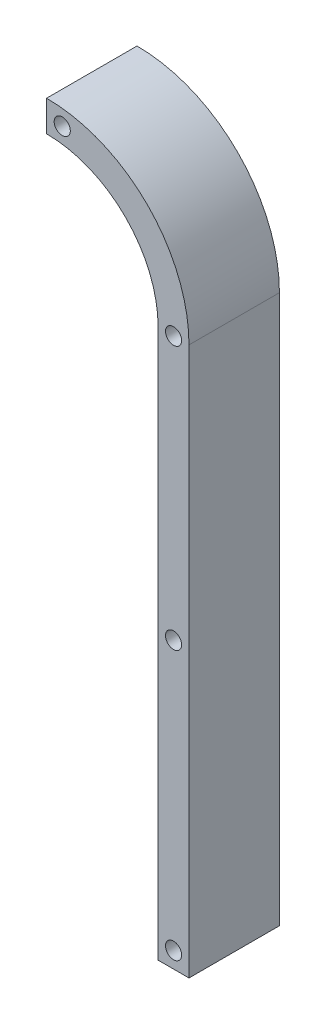
ISO-10303-21;
HEADER;
FILE_DESCRIPTION(('STEP AP214'),'2;1');
FILE_NAME('part.step','',(''),(''),'','','');
FILE_SCHEMA(('AUTOMOTIVE_DESIGN { 1 0 10303 214 1 1 1 1 }'));
ENDSEC;
DATA;
#1=APPLICATION_CONTEXT('core data for automotive mechanical design processes');
#2=APPLICATION_PROTOCOL_DEFINITION('international standard','automotive_design',2000,#1);
#3=PRODUCT_CONTEXT('',#1,'mechanical');
#4=PRODUCT('Part','Part','',(#3));
#5=PRODUCT_RELATED_PRODUCT_CATEGORY('part','',(#4));
#6=PRODUCT_DEFINITION_FORMATION('','',#4);
#7=PRODUCT_DEFINITION_CONTEXT('part definition',#1,'design');
#8=PRODUCT_DEFINITION('design','',#6,#7);
#9=PRODUCT_DEFINITION_SHAPE('','',#8);
#10=(LENGTH_UNIT() NAMED_UNIT(*) SI_UNIT(.MILLI.,.METRE.));
#11=(NAMED_UNIT(*) PLANE_ANGLE_UNIT() SI_UNIT($,.RADIAN.));
#12=(NAMED_UNIT(*) SI_UNIT($,.STERADIAN.) SOLID_ANGLE_UNIT());
#13=UNCERTAINTY_MEASURE_WITH_UNIT(LENGTH_MEASURE(1.E-05),#10,'distance_accuracy_value','');
#14=(GEOMETRIC_REPRESENTATION_CONTEXT(3) GLOBAL_UNCERTAINTY_ASSIGNED_CONTEXT((#13)) GLOBAL_UNIT_ASSIGNED_CONTEXT((#10,
#11,#12)) REPRESENTATION_CONTEXT('',''));
#15=CARTESIAN_POINT('',(0.,0.,0.));
#16=DIRECTION('',(0.,0.,1.));
#17=DIRECTION('',(1.,0.,0.));
#18=AXIS2_PLACEMENT_3D('',#15,#16,#17);
#19=CARTESIAN_POINT('',(-149.085368150531,212.188334745558,19.05));
#20=DIRECTION('',(0.,0.,-1.));
#21=DIRECTION('',(-1.,0.,0.));
#22=AXIS2_PLACEMENT_3D('',#19,#20,#21);
#23=CYLINDRICAL_SURFACE('',#22,23.5);
#24=CARTESIAN_POINT('',(-149.085368150531,212.188334745558,0.));
#25=DIRECTION('',(0.,0.,1.));
#26=DIRECTION('',(1.,0.,0.));
#27=AXIS2_PLACEMENT_3D('',#24,#25,#26);
#28=CIRCLE('',#27,23.5);
#29=CARTESIAN_POINT('',(-125.585368150531,212.188334745558,0.));
#30=VERTEX_POINT('',#29);
#31=CARTESIAN_POINT('',(-149.085368150531,235.688334745558,0.));
#32=VERTEX_POINT('',#31);
#33=EDGE_CURVE('E118',#30,#32,#28,.T.);
#34=ORIENTED_EDGE('',*,*,#33,.F.);
#35=DIRECTION('',(0.,0.,-1.));
#36=VECTOR('',#35,1.);
#37=CARTESIAN_POINT('',(-125.585368150531,212.188334745558,19.05));
#38=LINE('',#37,#36);
#39=CARTESIAN_POINT('',(-125.585368150531,212.188334745558,19.05));
#40=VERTEX_POINT('',#39);
#41=EDGE_CURVE('E11',#40,#30,#38,.T.);
#42=ORIENTED_EDGE('',*,*,#41,.F.);
#43=CARTESIAN_POINT('',(-149.085368150531,212.188334745558,19.05));
#44=DIRECTION('',(0.,0.,1.));
#45=DIRECTION('',(1.,0.,0.));
#46=AXIS2_PLACEMENT_3D('',#43,#44,#45);
#47=CIRCLE('',#46,23.5);
#48=CARTESIAN_POINT('',(-149.085368150531,235.688334745558,19.05));
#49=VERTEX_POINT('',#48);
#50=EDGE_CURVE('E133',#40,#49,#47,.T.);
#51=ORIENTED_EDGE('',*,*,#50,.T.);
#52=DIRECTION('',(0.,0.,-1.));
#53=VECTOR('',#52,1.);
#54=CARTESIAN_POINT('',(-149.085368150531,235.688334745558,19.05));
#55=LINE('',#54,#53);
#56=EDGE_CURVE('E36',#49,#32,#55,.T.);
#57=ORIENTED_EDGE('',*,*,#56,.T.);
#58=EDGE_LOOP('',(#34,#42,#51,#57));
#59=FACE_BOUND('',#58,.T.);
#60=ADVANCED_FACE('F33',(#59),#23,.F.);
#61=CARTESIAN_POINT('',(-125.585368150531,96.6995702810626,19.05));
#62=DIRECTION('',(-1.,0.,0.));
#63=DIRECTION('',(0.,-1.,0.));
#64=AXIS2_PLACEMENT_3D('',#61,#62,#63);
#65=PLANE('',#64);
#66=DIRECTION('',(0.,1.,0.));
#67=VECTOR('',#66,1.);
#68=CARTESIAN_POINT('',(-125.585368150531,96.6995702810626,0.));
#69=LINE('',#68,#67);
#70=CARTESIAN_POINT('',(-125.585368150531,96.6995702810626,0.));
#71=VERTEX_POINT('',#70);
#72=EDGE_CURVE('E131',#71,#30,#69,.T.);
#73=ORIENTED_EDGE('',*,*,#72,.F.);
#74=DIRECTION('',(0.,0.,-1.));
#75=VECTOR('',#74,1.);
#76=CARTESIAN_POINT('',(-125.585368150531,96.6995702810626,19.05));
#77=LINE('',#76,#75);
#78=CARTESIAN_POINT('',(-125.585368150531,96.6995702810626,19.05));
#79=VERTEX_POINT('',#78);
#80=EDGE_CURVE('E42',#79,#71,#77,.T.);
#81=ORIENTED_EDGE('',*,*,#80,.F.);
#82=DIRECTION('',(0.,1.,0.));
#83=VECTOR('',#82,1.);
#84=CARTESIAN_POINT('',(-125.585368150531,96.6995702810626,19.05));
#85=LINE('',#84,#83);
#86=EDGE_CURVE('E108',#79,#40,#85,.T.);
#87=ORIENTED_EDGE('',*,*,#86,.T.);
#88=ORIENTED_EDGE('',*,*,#41,.T.);
#89=EDGE_LOOP('',(#73,#81,#87,#88));
#90=FACE_BOUND('',#89,.T.);
#91=ADVANCED_FACE('F141',(#90),#65,.T.);
#92=CARTESIAN_POINT('',(-119.085368150531,96.6995702810626,19.05));
#93=DIRECTION('',(0.,-1.,0.));
#94=DIRECTION('',(0.,0.,-1.));
#95=AXIS2_PLACEMENT_3D('',#92,#93,#94);
#96=PLANE('',#95);
#97=DIRECTION('',(-1.,0.,0.));
#98=VECTOR('',#97,1.);
#99=CARTESIAN_POINT('',(-119.085368150531,96.6995702810626,0.));
#100=LINE('',#99,#98);
#101=CARTESIAN_POINT('',(-119.085368150531,96.6995702810626,0.));
#102=VERTEX_POINT('',#101);
#103=EDGE_CURVE('E95',#102,#71,#100,.T.);
#104=ORIENTED_EDGE('',*,*,#103,.F.);
#105=DIRECTION('',(0.,0.,-1.));
#106=VECTOR('',#105,1.);
#107=CARTESIAN_POINT('',(-119.085368150531,96.6995702810626,19.05));
#108=LINE('',#107,#106);
#109=CARTESIAN_POINT('',(-119.085368150531,96.6995702810626,19.05));
#110=VERTEX_POINT('',#109);
#111=EDGE_CURVE('E90',#110,#102,#108,.T.);
#112=ORIENTED_EDGE('',*,*,#111,.F.);
#113=DIRECTION('',(-1.,0.,0.));
#114=VECTOR('',#113,1.);
#115=CARTESIAN_POINT('',(-119.085368150531,96.6995702810626,19.05));
#116=LINE('',#115,#114);
#117=EDGE_CURVE('E93',#110,#79,#116,.T.);
#118=ORIENTED_EDGE('',*,*,#117,.T.);
#119=ORIENTED_EDGE('',*,*,#80,.T.);
#120=EDGE_LOOP('',(#104,#112,#118,#119));
#121=FACE_BOUND('',#120,.T.);
#122=ADVANCED_FACE('F92',(#121),#96,.T.);
#123=CARTESIAN_POINT('',(-119.085368150531,212.188334745558,19.05));
#124=DIRECTION('',(1.,0.,0.));
#125=DIRECTION('',(0.,0.,-1.));
#126=AXIS2_PLACEMENT_3D('',#123,#124,#125);
#127=PLANE('',#126);
#128=DIRECTION('',(0.,-1.,0.));
#129=VECTOR('',#128,1.);
#130=CARTESIAN_POINT('',(-119.085368150531,212.188334745558,0.));
#131=LINE('',#130,#129);
#132=CARTESIAN_POINT('',(-119.085368150531,212.188334745558,0.));
#133=VERTEX_POINT('',#132);
#134=EDGE_CURVE('E128',#133,#102,#131,.T.);
#135=ORIENTED_EDGE('',*,*,#134,.F.);
#136=DIRECTION('',(0.,0.,-1.));
#137=VECTOR('',#136,1.);
#138=CARTESIAN_POINT('',(-119.085368150531,212.188334745558,19.05));
#139=LINE('',#138,#137);
#140=CARTESIAN_POINT('',(-119.085368150531,212.188334745558,19.05));
#141=VERTEX_POINT('',#140);
#142=EDGE_CURVE('E100',#141,#133,#139,.T.);
#143=ORIENTED_EDGE('',*,*,#142,.F.);
#144=DIRECTION('',(0.,-1.,0.));
#145=VECTOR('',#144,1.);
#146=CARTESIAN_POINT('',(-119.085368150531,212.188334745558,19.05));
#147=LINE('',#146,#145);
#148=EDGE_CURVE('E106',#141,#110,#147,.T.);
#149=ORIENTED_EDGE('',*,*,#148,.T.);
#150=ORIENTED_EDGE('',*,*,#111,.T.);
#151=EDGE_LOOP('',(#135,#143,#149,#150));
#152=FACE_BOUND('',#151,.T.);
#153=ADVANCED_FACE('F110',(#152),#127,.T.);
#154=CARTESIAN_POINT('',(-149.085368150531,212.188334745558,19.05));
#155=DIRECTION('',(0.,0.,-1.));
#156=DIRECTION('',(-1.,0.,0.));
#157=AXIS2_PLACEMENT_3D('',#154,#155,#156);
#158=CYLINDRICAL_SURFACE('',#157,30.);
#159=CARTESIAN_POINT('',(-149.085368150531,212.188334745558,0.));
#160=DIRECTION('',(0.,0.,-1.));
#161=DIRECTION('',(-1.,0.,0.));
#162=AXIS2_PLACEMENT_3D('',#159,#160,#161);
#163=CIRCLE('',#162,30.);
#164=CARTESIAN_POINT('',(-149.085368150531,242.188334745558,0.));
#165=VERTEX_POINT('',#164);
#166=EDGE_CURVE('E125',#165,#133,#163,.T.);
#167=ORIENTED_EDGE('',*,*,#166,.F.);
#168=DIRECTION('',(0.,0.,-1.));
#169=VECTOR('',#168,1.);
#170=CARTESIAN_POINT('',(-149.085368150531,242.188334745558,19.05));
#171=LINE('',#170,#169);
#172=CARTESIAN_POINT('',(-149.085368150531,242.188334745558,19.05));
#173=VERTEX_POINT('',#172);
#174=EDGE_CURVE('E136',#173,#165,#171,.T.);
#175=ORIENTED_EDGE('',*,*,#174,.F.);
#176=CARTESIAN_POINT('',(-149.085368150531,212.188334745558,19.05));
#177=DIRECTION('',(0.,0.,-1.));
#178=DIRECTION('',(-1.,0.,0.));
#179=AXIS2_PLACEMENT_3D('',#176,#177,#178);
#180=CIRCLE('',#179,30.);
#181=EDGE_CURVE('E111',#173,#141,#180,.T.);
#182=ORIENTED_EDGE('',*,*,#181,.T.);
#183=ORIENTED_EDGE('',*,*,#142,.T.);
#184=EDGE_LOOP('',(#167,#175,#182,#183));
#185=FACE_BOUND('',#184,.T.);
#186=ADVANCED_FACE('F154',(#185),#158,.T.);
#187=CARTESIAN_POINT('',(-149.085368150531,235.688334745558,19.05));
#188=DIRECTION('',(-1.,0.,0.));
#189=DIRECTION('',(0.,0.,1.));
#190=AXIS2_PLACEMENT_3D('',#187,#188,#189);
#191=PLANE('',#190);
#192=DIRECTION('',(0.,1.,0.));
#193=VECTOR('',#192,1.);
#194=CARTESIAN_POINT('',(-149.085368150531,235.688334745558,0.));
#195=LINE('',#194,#193);
#196=EDGE_CURVE('E121',#32,#165,#195,.T.);
#197=ORIENTED_EDGE('',*,*,#196,.F.);
#198=ORIENTED_EDGE('',*,*,#56,.F.);
#199=DIRECTION('',(0.,1.,0.));
#200=VECTOR('',#199,1.);
#201=CARTESIAN_POINT('',(-149.085368150531,235.688334745558,19.05));
#202=LINE('',#201,#200);
#203=EDGE_CURVE('E113',#49,#173,#202,.T.);
#204=ORIENTED_EDGE('',*,*,#203,.T.);
#205=ORIENTED_EDGE('',*,*,#174,.T.);
#206=EDGE_LOOP('',(#197,#198,#204,#205));
#207=FACE_BOUND('',#206,.T.);
#208=ADVANCED_FACE('F138',(#207),#191,.T.);
#209=CARTESIAN_POINT('',(-149.085368150531,212.188334745558,19.05));
#210=DIRECTION('',(0.,0.,1.));
#211=DIRECTION('',(1.,0.,0.));
#212=AXIS2_PLACEMENT_3D('',#209,#210,#211);
#213=PLANE('',#212);
#214=CARTESIAN_POINT('',(-122.335368150531,100.099570281063,19.05));
#215=DIRECTION('',(0.,0.,-1.));
#216=DIRECTION('',(1.,0.,0.));
#217=AXIS2_PLACEMENT_3D('',#214,#215,#216);
#218=CIRCLE('',#217,1.69999999999999);
#219=CARTESIAN_POINT('',(-120.635368150531,100.099570281063,19.05));
#220=VERTEX_POINT('',#219);
#221=EDGE_CURVE('E188',#220,#220,#218,.T.);
#222=ORIENTED_EDGE('',*,*,#221,.T.);
#223=EDGE_LOOP('',(#222));
#224=FACE_BOUND('',#223,.T.);
#225=CARTESIAN_POINT('',(-122.335368150531,156.699570281063,19.05));
#226=DIRECTION('',(0.,0.,-1.));
#227=DIRECTION('',(1.,0.,0.));
#228=AXIS2_PLACEMENT_3D('',#225,#226,#227);
#229=CIRCLE('',#228,1.70000000000001);
#230=CARTESIAN_POINT('',(-120.635368150531,156.699570281063,19.05));
#231=VERTEX_POINT('',#230);
#232=EDGE_CURVE('E196',#231,#231,#229,.T.);
#233=ORIENTED_EDGE('',*,*,#232,.T.);
#234=EDGE_LOOP('',(#233));
#235=FACE_BOUND('',#234,.T.);
#236=CARTESIAN_POINT('',(-122.335368150529,212.18833474556,19.05));
#237=DIRECTION('',(0.,0.,-1.));
#238=DIRECTION('',(1.,0.,0.));
#239=AXIS2_PLACEMENT_3D('',#236,#237,#238);
#240=CIRCLE('',#239,1.70000000000001);
#241=CARTESIAN_POINT('',(-120.635368150529,212.18833474556,19.05));
#242=VERTEX_POINT('',#241);
#243=EDGE_CURVE('E202',#242,#242,#240,.T.);
#244=ORIENTED_EDGE('',*,*,#243,.T.);
#245=EDGE_LOOP('',(#244));
#246=FACE_BOUND('',#245,.T.);
#247=CARTESIAN_POINT('',(-145.785368150531,238.734002942083,19.05));
#248=DIRECTION('',(0.,0.,-1.));
#249=DIRECTION('',(1.,0.,0.));
#250=AXIS2_PLACEMENT_3D('',#247,#248,#249);
#251=CIRCLE('',#250,1.70000000000001);
#252=CARTESIAN_POINT('',(-144.085368150531,238.734002942083,19.05));
#253=VERTEX_POINT('',#252);
#254=EDGE_CURVE('E122',#253,#253,#251,.T.);
#255=ORIENTED_EDGE('',*,*,#254,.T.);
#256=EDGE_LOOP('',(#255));
#257=FACE_BOUND('',#256,.T.);
#258=ORIENTED_EDGE('',*,*,#50,.F.);
#259=ORIENTED_EDGE('',*,*,#86,.F.);
#260=ORIENTED_EDGE('',*,*,#117,.F.);
#261=ORIENTED_EDGE('',*,*,#148,.F.);
#262=ORIENTED_EDGE('',*,*,#181,.F.);
#263=ORIENTED_EDGE('',*,*,#203,.F.);
#264=EDGE_LOOP('',(#258,#259,#260,#261,#262,#263));
#265=FACE_BOUND('',#264,.T.);
#266=ADVANCED_FACE('F104',(#224,#235,#246,#257,#265),#213,.T.);
#267=CARTESIAN_POINT('',(-149.085368150531,212.188334745558,0.));
#268=DIRECTION('',(0.,0.,1.));
#269=DIRECTION('',(1.,0.,0.));
#270=AXIS2_PLACEMENT_3D('',#267,#268,#269);
#271=PLANE('',#270);
#272=CARTESIAN_POINT('',(-122.335368150531,100.099570281063,0.));
#273=DIRECTION('',(0.,0.,-1.));
#274=DIRECTION('',(1.,0.,0.));
#275=AXIS2_PLACEMENT_3D('',#272,#273,#274);
#276=CIRCLE('',#275,1.69999999999999);
#277=CARTESIAN_POINT('',(-120.635368150531,100.099570281063,0.));
#278=VERTEX_POINT('',#277);
#279=EDGE_CURVE('E191',#278,#278,#276,.T.);
#280=ORIENTED_EDGE('',*,*,#279,.F.);
#281=EDGE_LOOP('',(#280));
#282=FACE_BOUND('',#281,.T.);
#283=CARTESIAN_POINT('',(-122.335368150531,156.699570281063,0.));
#284=DIRECTION('',(0.,0.,-1.));
#285=DIRECTION('',(1.,0.,0.));
#286=AXIS2_PLACEMENT_3D('',#283,#284,#285);
#287=CIRCLE('',#286,1.70000000000001);
#288=CARTESIAN_POINT('',(-120.635368150531,156.699570281063,0.));
#289=VERTEX_POINT('',#288);
#290=EDGE_CURVE('E193',#289,#289,#287,.T.);
#291=ORIENTED_EDGE('',*,*,#290,.F.);
#292=EDGE_LOOP('',(#291));
#293=FACE_BOUND('',#292,.T.);
#294=CARTESIAN_POINT('',(-122.335368150529,212.18833474556,0.));
#295=DIRECTION('',(0.,0.,-1.));
#296=DIRECTION('',(1.,0.,0.));
#297=AXIS2_PLACEMENT_3D('',#294,#295,#296);
#298=CIRCLE('',#297,1.70000000000001);
#299=CARTESIAN_POINT('',(-120.635368150529,212.18833474556,0.));
#300=VERTEX_POINT('',#299);
#301=EDGE_CURVE('E199',#300,#300,#298,.T.);
#302=ORIENTED_EDGE('',*,*,#301,.F.);
#303=EDGE_LOOP('',(#302));
#304=FACE_BOUND('',#303,.T.);
#305=CARTESIAN_POINT('',(-145.785368150531,238.734002942083,0.));
#306=DIRECTION('',(0.,0.,-1.));
#307=DIRECTION('',(1.,0.,0.));
#308=AXIS2_PLACEMENT_3D('',#305,#306,#307);
#309=CIRCLE('',#308,1.70000000000001);
#310=CARTESIAN_POINT('',(-144.085368150531,238.734002942083,0.));
#311=VERTEX_POINT('',#310);
#312=EDGE_CURVE('E205',#311,#311,#309,.T.);
#313=ORIENTED_EDGE('',*,*,#312,.F.);
#314=EDGE_LOOP('',(#313));
#315=FACE_BOUND('',#314,.T.);
#316=ORIENTED_EDGE('',*,*,#33,.T.);
#317=ORIENTED_EDGE('',*,*,#196,.T.);
#318=ORIENTED_EDGE('',*,*,#166,.T.);
#319=ORIENTED_EDGE('',*,*,#134,.T.);
#320=ORIENTED_EDGE('',*,*,#103,.T.);
#321=ORIENTED_EDGE('',*,*,#72,.T.);
#322=EDGE_LOOP('',(#316,#317,#318,#319,#320,#321));
#323=FACE_BOUND('',#322,.T.);
#324=ADVANCED_FACE('F140',(#282,#293,#304,#315,#323),#271,.F.);
#325=CARTESIAN_POINT('',(-145.785368150531,238.734002942083,19.05));
#326=DIRECTION('',(0.,0.,-1.));
#327=DIRECTION('',(-1.,0.,0.));
#328=AXIS2_PLACEMENT_3D('',#325,#326,#327);
#329=CYLINDRICAL_SURFACE('',#328,1.70000000000001);
#330=ORIENTED_EDGE('',*,*,#254,.F.);
#331=EDGE_LOOP('',(#330));
#332=FACE_BOUND('',#331,.T.);
#333=ORIENTED_EDGE('',*,*,#312,.T.);
#334=EDGE_LOOP('',(#333));
#335=FACE_BOUND('',#334,.T.);
#336=ADVANCED_FACE('F165',(#332,#335),#329,.F.);
#337=CARTESIAN_POINT('',(-122.335368150529,212.18833474556,19.05));
#338=DIRECTION('',(0.,0.,-1.));
#339=DIRECTION('',(-1.,0.,0.));
#340=AXIS2_PLACEMENT_3D('',#337,#338,#339);
#341=CYLINDRICAL_SURFACE('',#340,1.70000000000001);
#342=ORIENTED_EDGE('',*,*,#243,.F.);
#343=EDGE_LOOP('',(#342));
#344=FACE_BOUND('',#343,.T.);
#345=ORIENTED_EDGE('',*,*,#301,.T.);
#346=EDGE_LOOP('',(#345));
#347=FACE_BOUND('',#346,.T.);
#348=ADVANCED_FACE('F172',(#344,#347),#341,.F.);
#349=CARTESIAN_POINT('',(-122.335368150531,156.699570281063,19.05));
#350=DIRECTION('',(0.,0.,-1.));
#351=DIRECTION('',(-1.,0.,0.));
#352=AXIS2_PLACEMENT_3D('',#349,#350,#351);
#353=CYLINDRICAL_SURFACE('',#352,1.70000000000001);
#354=ORIENTED_EDGE('',*,*,#232,.F.);
#355=EDGE_LOOP('',(#354));
#356=FACE_BOUND('',#355,.T.);
#357=ORIENTED_EDGE('',*,*,#290,.T.);
#358=EDGE_LOOP('',(#357));
#359=FACE_BOUND('',#358,.T.);
#360=ADVANCED_FACE('F176',(#356,#359),#353,.F.);
#361=CARTESIAN_POINT('',(-122.335368150531,100.099570281063,19.05));
#362=DIRECTION('',(0.,0.,-1.));
#363=DIRECTION('',(-1.,0.,0.));
#364=AXIS2_PLACEMENT_3D('',#361,#362,#363);
#365=CYLINDRICAL_SURFACE('',#364,1.69999999999999);
#366=ORIENTED_EDGE('',*,*,#221,.F.);
#367=EDGE_LOOP('',(#366));
#368=FACE_BOUND('',#367,.T.);
#369=ORIENTED_EDGE('',*,*,#279,.T.);
#370=EDGE_LOOP('',(#369));
#371=FACE_BOUND('',#370,.T.);
#372=ADVANCED_FACE('F180',(#368,#371),#365,.F.);
#373=CLOSED_SHELL('',(#60,#91,#122,#153,#186,#208,#266,#324,#336,#348,#360,#372));
#374=MANIFOLD_SOLID_BREP('B2',#373);
#375=ADVANCED_BREP_SHAPE_REPRESENTATION('',(#18,#374),#14);
#376=SHAPE_DEFINITION_REPRESENTATION(#9,#375);
ENDSEC;
END-ISO-10303-21;
